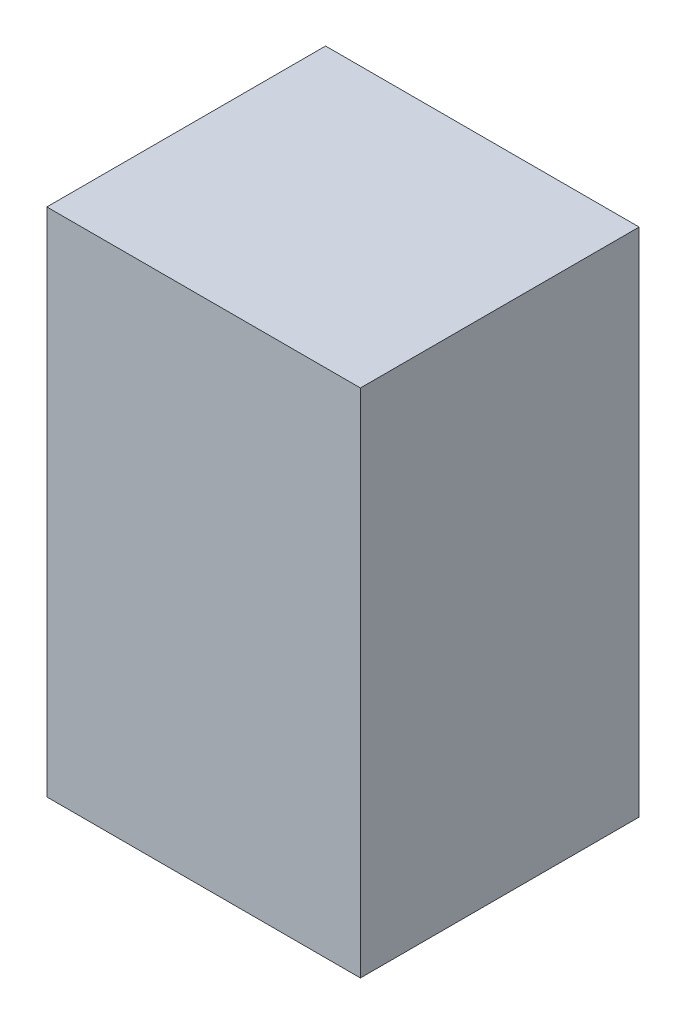
ISO-10303-21;
HEADER;
FILE_DESCRIPTION(('STEP AP214'),'2;1');
FILE_NAME('part.step','',(''),(''),'','','');
FILE_SCHEMA(('AUTOMOTIVE_DESIGN { 1 0 10303 214 1 1 1 1 }'));
ENDSEC;
DATA;
#1=APPLICATION_CONTEXT('core data for automotive mechanical design processes');
#2=APPLICATION_PROTOCOL_DEFINITION('international standard','automotive_design',2000,#1);
#3=PRODUCT_CONTEXT('',#1,'mechanical');
#4=PRODUCT('Part','Part','',(#3));
#5=PRODUCT_RELATED_PRODUCT_CATEGORY('part','',(#4));
#6=PRODUCT_DEFINITION_FORMATION('','',#4);
#7=PRODUCT_DEFINITION_CONTEXT('part definition',#1,'design');
#8=PRODUCT_DEFINITION('design','',#6,#7);
#9=PRODUCT_DEFINITION_SHAPE('','',#8);
#10=(LENGTH_UNIT() NAMED_UNIT(*) SI_UNIT(.MILLI.,.METRE.));
#11=(NAMED_UNIT(*) PLANE_ANGLE_UNIT() SI_UNIT($,.RADIAN.));
#12=(NAMED_UNIT(*) SI_UNIT($,.STERADIAN.) SOLID_ANGLE_UNIT());
#13=UNCERTAINTY_MEASURE_WITH_UNIT(LENGTH_MEASURE(1.E-05),#10,'distance_accuracy_value','');
#14=(GEOMETRIC_REPRESENTATION_CONTEXT(3) GLOBAL_UNCERTAINTY_ASSIGNED_CONTEXT((#13)) GLOBAL_UNIT_ASSIGNED_CONTEXT((#10,
#11,#12)) REPRESENTATION_CONTEXT('',''));
#15=CARTESIAN_POINT('',(0.,0.,0.));
#16=DIRECTION('',(0.,0.,1.));
#17=DIRECTION('',(1.,0.,0.));
#18=AXIS2_PLACEMENT_3D('',#15,#16,#17);
#19=CARTESIAN_POINT('',(-0.67499992,1.10000034,1.2));
#20=DIRECTION('',(0.,0.,1.));
#21=DIRECTION('',(1.,0.,0.));
#22=AXIS2_PLACEMENT_3D('',#19,#20,#21);
#23=PLANE('',#22);
#24=DIRECTION('',(0.,1.,0.));
#25=VECTOR('',#24,1.);
#26=CARTESIAN_POINT('',(0.67499992,1.10000034,1.2));
#27=LINE('',#26,#25);
#28=CARTESIAN_POINT('',(0.67499992,1.10000034,1.2));
#29=VERTEX_POINT('',#28);
#30=CARTESIAN_POINT('',(0.67499992,-1.10000034,1.2));
#31=VERTEX_POINT('',#30);
#32=EDGE_CURVE('E53',#29,#31,#27,.F.);
#33=ORIENTED_EDGE('',*,*,#32,.F.);
#34=DIRECTION('',(1.,0.,0.));
#35=VECTOR('',#34,1.);
#36=CARTESIAN_POINT('',(-0.67499992,1.10000034,1.2));
#37=LINE('',#36,#35);
#38=CARTESIAN_POINT('',(-0.67499992,1.10000034,1.2));
#39=VERTEX_POINT('',#38);
#40=EDGE_CURVE('E20',#29,#39,#37,.F.);
#41=ORIENTED_EDGE('',*,*,#40,.T.);
#42=DIRECTION('',(0.,1.,0.));
#43=VECTOR('',#42,1.);
#44=CARTESIAN_POINT('',(-0.67499992,-1.10000034,1.2));
#45=LINE('',#44,#43);
#46=CARTESIAN_POINT('',(-0.67499992,-1.10000034,1.2));
#47=VERTEX_POINT('',#46);
#48=EDGE_CURVE('E67',#47,#39,#45,.T.);
#49=ORIENTED_EDGE('',*,*,#48,.F.);
#50=DIRECTION('',(1.,0.,0.));
#51=VECTOR('',#50,1.);
#52=CARTESIAN_POINT('',(0.67499992,-1.10000034,1.2));
#53=LINE('',#52,#51);
#54=EDGE_CURVE('E58',#31,#47,#53,.F.);
#55=ORIENTED_EDGE('',*,*,#54,.F.);
#56=EDGE_LOOP('',(#33,#41,#49,#55));
#57=FACE_BOUND('',#56,.T.);
#58=ADVANCED_FACE('F17',(#57),#23,.T.);
#59=CARTESIAN_POINT('',(-0.67499992,-1.10000034,0.));
#60=DIRECTION('',(-1.,0.,0.));
#61=DIRECTION('',(0.,0.,1.));
#62=AXIS2_PLACEMENT_3D('',#59,#60,#61);
#63=PLANE('',#62);
#64=DIRECTION('',(0.,0.,1.));
#65=VECTOR('',#64,1.);
#66=CARTESIAN_POINT('',(-0.67499992,1.10000034,0.));
#67=LINE('',#66,#65);
#68=CARTESIAN_POINT('',(-0.67499992,1.10000034,0.));
#69=VERTEX_POINT('',#68);
#70=EDGE_CURVE('E80',#69,#39,#67,.T.);
#71=ORIENTED_EDGE('',*,*,#70,.F.);
#72=DIRECTION('',(0.,1.,0.));
#73=VECTOR('',#72,1.);
#74=CARTESIAN_POINT('',(-0.67499992,1.10000034,0.));
#75=LINE('',#74,#73);
#76=CARTESIAN_POINT('',(-0.67499992,-1.10000034,0.));
#77=VERTEX_POINT('',#76);
#78=EDGE_CURVE('E75',#69,#77,#75,.F.);
#79=ORIENTED_EDGE('',*,*,#78,.T.);
#80=DIRECTION('',(0.,0.,-1.));
#81=VECTOR('',#80,1.);
#82=CARTESIAN_POINT('',(-0.67499992,-1.10000034,0.));
#83=LINE('',#82,#81);
#84=EDGE_CURVE('E63',#47,#77,#83,.T.);
#85=ORIENTED_EDGE('',*,*,#84,.F.);
#86=ORIENTED_EDGE('',*,*,#48,.T.);
#87=EDGE_LOOP('',(#71,#79,#85,#86));
#88=FACE_BOUND('',#87,.T.);
#89=ADVANCED_FACE('F74',(#88),#63,.T.);
#90=CARTESIAN_POINT('',(0.67499992,-1.10000034,0.));
#91=DIRECTION('',(0.,-1.,0.));
#92=DIRECTION('',(0.,0.,-1.));
#93=AXIS2_PLACEMENT_3D('',#90,#91,#92);
#94=PLANE('',#93);
#95=ORIENTED_EDGE('',*,*,#84,.T.);
#96=DIRECTION('',(1.,0.,0.));
#97=VECTOR('',#96,1.);
#98=CARTESIAN_POINT('',(-0.67499992,-1.10000034,0.));
#99=LINE('',#98,#97);
#100=CARTESIAN_POINT('',(0.67499992,-1.10000034,0.));
#101=VERTEX_POINT('',#100);
#102=EDGE_CURVE('E84',#77,#101,#99,.T.);
#103=ORIENTED_EDGE('',*,*,#102,.T.);
#104=DIRECTION('',(0.,0.,-1.));
#105=VECTOR('',#104,1.);
#106=CARTESIAN_POINT('',(0.67499992,-1.10000034,0.));
#107=LINE('',#106,#105);
#108=EDGE_CURVE('E65',#31,#101,#107,.T.);
#109=ORIENTED_EDGE('',*,*,#108,.F.);
#110=ORIENTED_EDGE('',*,*,#54,.T.);
#111=EDGE_LOOP('',(#95,#103,#109,#110));
#112=FACE_BOUND('',#111,.T.);
#113=ADVANCED_FACE('F60',(#112),#94,.T.);
#114=CARTESIAN_POINT('',(0.67499992,1.10000034,0.));
#115=DIRECTION('',(1.,0.,0.));
#116=DIRECTION('',(0.,0.,-1.));
#117=AXIS2_PLACEMENT_3D('',#114,#115,#116);
#118=PLANE('',#117);
#119=ORIENTED_EDGE('',*,*,#108,.T.);
#120=DIRECTION('',(0.,1.,0.));
#121=VECTOR('',#120,1.);
#122=CARTESIAN_POINT('',(0.67499992,1.10000034,0.));
#123=LINE('',#122,#121);
#124=CARTESIAN_POINT('',(0.67499992,1.10000034,0.));
#125=VERTEX_POINT('',#124);
#126=EDGE_CURVE('E26',#101,#125,#123,.T.);
#127=ORIENTED_EDGE('',*,*,#126,.T.);
#128=DIRECTION('',(0.,0.,1.));
#129=VECTOR('',#128,1.);
#130=CARTESIAN_POINT('',(0.67499992,1.10000034,0.));
#131=LINE('',#130,#129);
#132=EDGE_CURVE('E34',#29,#125,#131,.F.);
#133=ORIENTED_EDGE('',*,*,#132,.F.);
#134=ORIENTED_EDGE('',*,*,#32,.T.);
#135=EDGE_LOOP('',(#119,#127,#133,#134));
#136=FACE_BOUND('',#135,.T.);
#137=ADVANCED_FACE('F88',(#136),#118,.T.);
#138=CARTESIAN_POINT('',(-0.67499992,1.10000034,0.));
#139=DIRECTION('',(0.,1.,0.));
#140=DIRECTION('',(0.,0.,1.));
#141=AXIS2_PLACEMENT_3D('',#138,#139,#140);
#142=PLANE('',#141);
#143=ORIENTED_EDGE('',*,*,#132,.T.);
#144=DIRECTION('',(1.,0.,0.));
#145=VECTOR('',#144,1.);
#146=CARTESIAN_POINT('',(-0.67499992,1.10000034,0.));
#147=LINE('',#146,#145);
#148=EDGE_CURVE('E11',#125,#69,#147,.F.);
#149=ORIENTED_EDGE('',*,*,#148,.T.);
#150=ORIENTED_EDGE('',*,*,#70,.T.);
#151=ORIENTED_EDGE('',*,*,#40,.F.);
#152=EDGE_LOOP('',(#143,#149,#150,#151));
#153=FACE_BOUND('',#152,.T.);
#154=ADVANCED_FACE('F91',(#153),#142,.T.);
#155=CARTESIAN_POINT('',(-0.67499992,1.10000034,0.));
#156=DIRECTION('',(0.,0.,1.));
#157=DIRECTION('',(1.,0.,0.));
#158=AXIS2_PLACEMENT_3D('',#155,#156,#157);
#159=PLANE('',#158);
#160=ORIENTED_EDGE('',*,*,#126,.F.);
#161=ORIENTED_EDGE('',*,*,#102,.F.);
#162=ORIENTED_EDGE('',*,*,#78,.F.);
#163=ORIENTED_EDGE('',*,*,#148,.F.);
#164=EDGE_LOOP('',(#160,#161,#162,#163));
#165=FACE_BOUND('',#164,.T.);
#166=ADVANCED_FACE('F90',(#165),#159,.F.);
#167=CLOSED_SHELL('',(#58,#89,#113,#137,#154,#166));
#168=MANIFOLD_SOLID_BREP('B1',#167);
#169=ADVANCED_BREP_SHAPE_REPRESENTATION('',(#18,#168),#14);
#170=SHAPE_DEFINITION_REPRESENTATION(#9,#169);
ENDSEC;
END-ISO-10303-21;
